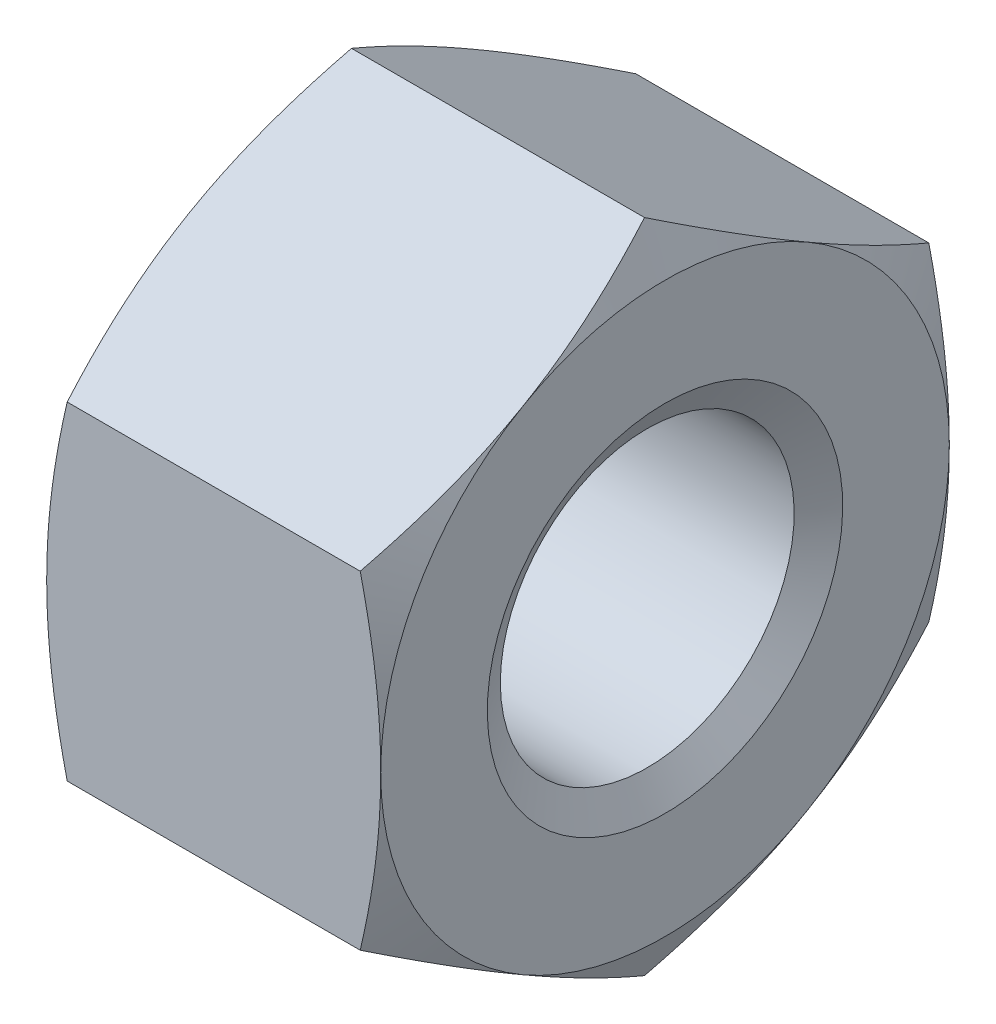
ISO-10303-21;
HEADER;
FILE_DESCRIPTION(('STEP AP214'),'2;1');
FILE_NAME('part.step','',(''),(''),'','','');
FILE_SCHEMA(('AUTOMOTIVE_DESIGN { 1 0 10303 214 1 1 1 1 }'));
ENDSEC;
DATA;
#1=APPLICATION_CONTEXT('core data for automotive mechanical design processes');
#2=APPLICATION_PROTOCOL_DEFINITION('international standard','automotive_design',2000,#1);
#3=PRODUCT_CONTEXT('',#1,'mechanical');
#4=PRODUCT('Part','Part','',(#3));
#5=PRODUCT_RELATED_PRODUCT_CATEGORY('part','',(#4));
#6=PRODUCT_DEFINITION_FORMATION('','',#4);
#7=PRODUCT_DEFINITION_CONTEXT('part definition',#1,'design');
#8=PRODUCT_DEFINITION('design','',#6,#7);
#9=PRODUCT_DEFINITION_SHAPE('','',#8);
#10=(LENGTH_UNIT() NAMED_UNIT(*) SI_UNIT(.MILLI.,.METRE.));
#11=(NAMED_UNIT(*) PLANE_ANGLE_UNIT() SI_UNIT($,.RADIAN.));
#12=(NAMED_UNIT(*) SI_UNIT($,.STERADIAN.) SOLID_ANGLE_UNIT());
#13=UNCERTAINTY_MEASURE_WITH_UNIT(LENGTH_MEASURE(1.E-05),#10,'distance_accuracy_value','');
#14=(GEOMETRIC_REPRESENTATION_CONTEXT(3) GLOBAL_UNCERTAINTY_ASSIGNED_CONTEXT((#13)) GLOBAL_UNIT_ASSIGNED_CONTEXT((#10,
#11,#12)) REPRESENTATION_CONTEXT('',''));
#15=CARTESIAN_POINT('',(0.,0.,0.));
#16=DIRECTION('',(0.,0.,1.));
#17=DIRECTION('',(1.,0.,0.));
#18=AXIS2_PLACEMENT_3D('',#15,#16,#17);
#19=CARTESIAN_POINT('',(0.125,0.,0.));
#20=DIRECTION('',(-1.,0.,0.));
#21=DIRECTION('',(0.,0.,1.));
#22=AXIS2_PLACEMENT_3D('',#19,#20,#21);
#23=CONICAL_SURFACE('',#22,2.28350635094611,1.0471975511966);
#24=CARTESIAN_POINT('',(0.25,0.,0.));
#25=DIRECTION('',(1.,0.,0.));
#26=DIRECTION('',(0.,1.,0.));
#27=AXIS2_PLACEMENT_3D('',#24,#25,#26);
#28=CIRCLE('',#27,2.067);
#29=CARTESIAN_POINT('',(0.25,2.067,0.));
#30=VERTEX_POINT('',#29);
#31=EDGE_CURVE('E10',#30,#30,#28,.T.);
#32=ORIENTED_EDGE('',*,*,#31,.T.);
#33=EDGE_LOOP('',(#32));
#34=FACE_BOUND('',#33,.T.);
#35=CARTESIAN_POINT('',(0.,0.,0.));
#36=DIRECTION('',(-1.,0.,0.));
#37=DIRECTION('',(0.,0.,1.));
#38=AXIS2_PLACEMENT_3D('',#35,#36,#37);
#39=CIRCLE('',#38,2.50001270189222);
#40=CARTESIAN_POINT('',(0.,0.,2.50001270189222));
#41=VERTEX_POINT('',#40);
#42=EDGE_CURVE('E25',#41,#41,#39,.T.);
#43=ORIENTED_EDGE('',*,*,#42,.T.);
#44=EDGE_LOOP('',(#43));
#45=FACE_BOUND('',#44,.T.);
#46=ADVANCED_FACE('F15',(#34,#45),#23,.F.);
#47=CARTESIAN_POINT('',(-8.39287337956546,0.,0.));
#48=DIRECTION('',(1.,0.,0.));
#49=DIRECTION('',(0.,1.,0.));
#50=AXIS2_PLACEMENT_3D('',#47,#48,#49);
#51=CYLINDRICAL_SURFACE('',#50,2.067);
#52=CARTESIAN_POINT('',(4.45,0.,0.));
#53=DIRECTION('',(-1.,0.,0.));
#54=DIRECTION('',(0.,0.,1.));
#55=AXIS2_PLACEMENT_3D('',#52,#53,#54);
#56=CIRCLE('',#55,2.067);
#57=CARTESIAN_POINT('',(4.45,0.,2.067));
#58=VERTEX_POINT('',#57);
#59=EDGE_CURVE('E330',#58,#58,#56,.T.);
#60=ORIENTED_EDGE('',*,*,#59,.F.);
#61=EDGE_LOOP('',(#60));
#62=FACE_BOUND('',#61,.T.);
#63=ORIENTED_EDGE('',*,*,#31,.F.);
#64=EDGE_LOOP('',(#63));
#65=FACE_BOUND('',#64,.T.);
#66=ADVANCED_FACE('F358',(#62,#65),#51,.F.);
#67=CARTESIAN_POINT('',(0.,0.,0.));
#68=DIRECTION('',(1.,0.,0.));
#69=DIRECTION('',(0.,0.,-1.));
#70=AXIS2_PLACEMENT_3D('',#67,#68,#69);
#71=PLANE('',#70);
#72=CARTESIAN_POINT('',(0.,0.,0.));
#73=DIRECTION('',(-1.,0.,0.));
#74=DIRECTION('',(0.,0.,1.));
#75=AXIS2_PLACEMENT_3D('',#72,#73,#74);
#76=CIRCLE('',#75,4.);
#77=CARTESIAN_POINT('',(0.,-3.46410161513775,-2.));
#78=VERTEX_POINT('',#77);
#79=CARTESIAN_POINT('',(0.,-3.46410161513776,2.));
#80=VERTEX_POINT('',#79);
#81=EDGE_CURVE('E346',#78,#80,#76,.T.);
#82=ORIENTED_EDGE('',*,*,#81,.T.);
#83=CARTESIAN_POINT('',(0.,0.,0.));
#84=DIRECTION('',(-1.,0.,0.));
#85=DIRECTION('',(0.,0.,1.));
#86=AXIS2_PLACEMENT_3D('',#83,#84,#85);
#87=CIRCLE('',#86,4.);
#88=CARTESIAN_POINT('',(0.,0.,4.));
#89=VERTEX_POINT('',#88);
#90=EDGE_CURVE('E343',#80,#89,#87,.T.);
#91=ORIENTED_EDGE('',*,*,#90,.T.);
#92=CARTESIAN_POINT('',(0.,0.,0.));
#93=DIRECTION('',(-1.,0.,0.));
#94=DIRECTION('',(0.,0.,1.));
#95=AXIS2_PLACEMENT_3D('',#92,#93,#94);
#96=CIRCLE('',#95,4.);
#97=CARTESIAN_POINT('',(0.,3.46410161513775,2.));
#98=VERTEX_POINT('',#97);
#99=EDGE_CURVE('E340',#89,#98,#96,.T.);
#100=ORIENTED_EDGE('',*,*,#99,.T.);
#101=CARTESIAN_POINT('',(0.,0.,0.));
#102=DIRECTION('',(-1.,0.,0.));
#103=DIRECTION('',(0.,0.,1.));
#104=AXIS2_PLACEMENT_3D('',#101,#102,#103);
#105=CIRCLE('',#104,4.);
#106=CARTESIAN_POINT('',(0.,3.46410161513776,-2.));
#107=VERTEX_POINT('',#106);
#108=EDGE_CURVE('E337',#98,#107,#105,.T.);
#109=ORIENTED_EDGE('',*,*,#108,.T.);
#110=CARTESIAN_POINT('',(0.,0.,0.));
#111=DIRECTION('',(-1.,0.,0.));
#112=DIRECTION('',(0.,0.,1.));
#113=AXIS2_PLACEMENT_3D('',#110,#111,#112);
#114=CIRCLE('',#113,4.);
#115=CARTESIAN_POINT('',(0.,0.,-4.));
#116=VERTEX_POINT('',#115);
#117=EDGE_CURVE('E334',#107,#116,#114,.T.);
#118=ORIENTED_EDGE('',*,*,#117,.T.);
#119=CARTESIAN_POINT('',(0.,0.,0.));
#120=DIRECTION('',(-1.,0.,0.));
#121=DIRECTION('',(0.,0.,1.));
#122=AXIS2_PLACEMENT_3D('',#119,#120,#121);
#123=CIRCLE('',#122,4.);
#124=EDGE_CURVE('E331',#116,#78,#123,.T.);
#125=ORIENTED_EDGE('',*,*,#124,.T.);
#126=EDGE_LOOP('',(#82,#91,#100,#109,#118,#125));
#127=FACE_BOUND('',#126,.T.);
#128=ORIENTED_EDGE('',*,*,#42,.F.);
#129=EDGE_LOOP('',(#128));
#130=FACE_BOUND('',#129,.T.);
#131=ADVANCED_FACE('F355',(#127,#130),#71,.F.);
#132=CARTESIAN_POINT('',(4.575,0.,0.));
#133=DIRECTION('',(1.,0.,0.));
#134=DIRECTION('',(0.,1.,0.));
#135=AXIS2_PLACEMENT_3D('',#132,#133,#134);
#136=CONICAL_SURFACE('',#135,2.28350635094611,1.0471975511966);
#137=ORIENTED_EDGE('',*,*,#59,.T.);
#138=EDGE_LOOP('',(#137));
#139=FACE_BOUND('',#138,.T.);
#140=CARTESIAN_POINT('',(4.7,0.,0.));
#141=DIRECTION('',(1.,0.,0.));
#142=DIRECTION('',(0.,1.,0.));
#143=AXIS2_PLACEMENT_3D('',#140,#141,#142);
#144=CIRCLE('',#143,2.50001270189222);
#145=CARTESIAN_POINT('',(4.7,2.50001270189222,0.));
#146=VERTEX_POINT('',#145);
#147=EDGE_CURVE('E327',#146,#146,#144,.T.);
#148=ORIENTED_EDGE('',*,*,#147,.T.);
#149=EDGE_LOOP('',(#148));
#150=FACE_BOUND('',#149,.T.);
#151=ADVANCED_FACE('F357',(#139,#150),#136,.F.);
#152=CARTESIAN_POINT('',(4.7,0.,0.));
#153=DIRECTION('',(1.,0.,0.));
#154=DIRECTION('',(0.,0.,-1.));
#155=AXIS2_PLACEMENT_3D('',#152,#153,#154);
#156=PLANE('',#155);
#157=CARTESIAN_POINT('',(4.7,0.,0.));
#158=DIRECTION('',(1.,0.,0.));
#159=DIRECTION('',(0.,1.,0.));
#160=AXIS2_PLACEMENT_3D('',#157,#158,#159);
#161=CIRCLE('',#160,4.);
#162=CARTESIAN_POINT('',(4.7,-3.46410161513775,-2.));
#163=VERTEX_POINT('',#162);
#164=CARTESIAN_POINT('',(4.7,0.,-4.));
#165=VERTEX_POINT('',#164);
#166=EDGE_CURVE('E324',#163,#165,#161,.T.);
#167=ORIENTED_EDGE('',*,*,#166,.T.);
#168=CARTESIAN_POINT('',(4.7,0.,0.));
#169=DIRECTION('',(1.,0.,0.));
#170=DIRECTION('',(0.,1.,0.));
#171=AXIS2_PLACEMENT_3D('',#168,#169,#170);
#172=CIRCLE('',#171,4.);
#173=CARTESIAN_POINT('',(4.7,3.46410161513776,-2.));
#174=VERTEX_POINT('',#173);
#175=EDGE_CURVE('E322',#165,#174,#172,.T.);
#176=ORIENTED_EDGE('',*,*,#175,.T.);
#177=CARTESIAN_POINT('',(4.7,0.,0.));
#178=DIRECTION('',(1.,0.,0.));
#179=DIRECTION('',(0.,1.,0.));
#180=AXIS2_PLACEMENT_3D('',#177,#178,#179);
#181=CIRCLE('',#180,4.);
#182=CARTESIAN_POINT('',(4.7,3.46410161513775,2.));
#183=VERTEX_POINT('',#182);
#184=EDGE_CURVE('E112',#174,#183,#181,.T.);
#185=ORIENTED_EDGE('',*,*,#184,.T.);
#186=CARTESIAN_POINT('',(4.7,0.,0.));
#187=DIRECTION('',(1.,0.,0.));
#188=DIRECTION('',(0.,1.,0.));
#189=AXIS2_PLACEMENT_3D('',#186,#187,#188);
#190=CIRCLE('',#189,4.);
#191=CARTESIAN_POINT('',(4.7,0.,4.));
#192=VERTEX_POINT('',#191);
#193=EDGE_CURVE('E318',#183,#192,#190,.T.);
#194=ORIENTED_EDGE('',*,*,#193,.T.);
#195=CARTESIAN_POINT('',(4.7,0.,0.));
#196=DIRECTION('',(1.,0.,0.));
#197=DIRECTION('',(0.,1.,0.));
#198=AXIS2_PLACEMENT_3D('',#195,#196,#197);
#199=CIRCLE('',#198,4.);
#200=CARTESIAN_POINT('',(4.7,-3.46410161513776,2.));
#201=VERTEX_POINT('',#200);
#202=EDGE_CURVE('E315',#192,#201,#199,.T.);
#203=ORIENTED_EDGE('',*,*,#202,.T.);
#204=CARTESIAN_POINT('',(4.7,0.,0.));
#205=DIRECTION('',(1.,0.,0.));
#206=DIRECTION('',(0.,1.,0.));
#207=AXIS2_PLACEMENT_3D('',#204,#205,#206);
#208=CIRCLE('',#207,4.);
#209=EDGE_CURVE('E237',#201,#163,#208,.T.);
#210=ORIENTED_EDGE('',*,*,#209,.T.);
#211=EDGE_LOOP('',(#167,#176,#185,#194,#203,#210));
#212=FACE_BOUND('',#211,.T.);
#213=ORIENTED_EDGE('',*,*,#147,.F.);
#214=EDGE_LOOP('',(#213));
#215=FACE_BOUND('',#214,.T.);
#216=ADVANCED_FACE('F366',(#212,#215),#156,.T.);
#217=CARTESIAN_POINT('',(0.144276091533892,0.,0.));
#218=DIRECTION('',(1.,0.,0.));
#219=DIRECTION('',(0.,0.,1.));
#220=AXIS2_PLACEMENT_3D('',#217,#218,#219);
#221=CONICAL_SURFACE('',#220,4.3094010767585,1.13446401379631);
#222=CARTESIAN_POINT('',(0.,-3.46410161513776,2.));
#223=CARTESIAN_POINT('',(0.,-4.,1.07179676972449));
#224=CARTESIAN_POINT('',(0.288552183067785,-4.618802153517,0.));
#225=(BOUNDED_CURVE() B_SPLINE_CURVE(2,(#222,#223,#224),.UNSPECIFIED.,.F.,
.F.) B_SPLINE_CURVE_WITH_KNOTS((3,3),(0.233129855179429,0.466259710358859),
.UNSPECIFIED.) CURVE() GEOMETRIC_REPRESENTATION_ITEM() RATIONAL_B_SPLINE_CURVE((1.,
1.03795484930205,1.)) REPRESENTATION_ITEM(''));
#226=CARTESIAN_POINT('',(0.288552183067785,-4.61880215351701,0.));
#227=VERTEX_POINT('',#226);
#228=EDGE_CURVE('E34',#80,#227,#225,.T.);
#229=ORIENTED_EDGE('',*,*,#228,.F.);
#230=ORIENTED_EDGE('',*,*,#81,.F.);
#231=CARTESIAN_POINT('',(0.288552183067785,-4.61880215351701,0.));
#232=CARTESIAN_POINT('',(0.,-4.,-1.07179676972449));
#233=CARTESIAN_POINT('',(0.,-3.46410161513775,-2.));
#234=(BOUNDED_CURVE() B_SPLINE_CURVE(2,(#231,#232,#233),.UNSPECIFIED.,.F.,
.F.) B_SPLINE_CURVE_WITH_KNOTS((3,3),(0.,0.23312985517943),
.UNSPECIFIED.) CURVE() GEOMETRIC_REPRESENTATION_ITEM() RATIONAL_B_SPLINE_CURVE((1.,
1.03795484930204,1.)) REPRESENTATION_ITEM(''));
#235=EDGE_CURVE('E224',#227,#78,#234,.T.);
#236=ORIENTED_EDGE('',*,*,#235,.F.);
#237=EDGE_LOOP('',(#229,#230,#236));
#238=FACE_BOUND('',#237,.T.);
#239=ADVANCED_FACE('F379',(#238),#221,.T.);
#240=CARTESIAN_POINT('',(0.144276091533892,0.,0.));
#241=DIRECTION('',(1.,0.,0.));
#242=DIRECTION('',(0.,0.,1.));
#243=AXIS2_PLACEMENT_3D('',#240,#241,#242);
#244=CONICAL_SURFACE('',#243,4.3094010767585,1.13446401379631);
#245=CARTESIAN_POINT('',(0.288552183067785,-2.30940107675848,-4.00000000000001));
#246=CARTESIAN_POINT('',(0.,-1.07179676972447,-4.00000000000001));
#247=CARTESIAN_POINT('',(0.,0.,-4.));
#248=(BOUNDED_CURVE() B_SPLINE_CURVE(2,(#245,#246,#247),.UNSPECIFIED.,.F.,
.F.) B_SPLINE_CURVE_WITH_KNOTS((3,3),(0.,0.233129855179429),
.UNSPECIFIED.) CURVE() GEOMETRIC_REPRESENTATION_ITEM() RATIONAL_B_SPLINE_CURVE((1.,
1.03795484930204,1.)) REPRESENTATION_ITEM(''));
#249=CARTESIAN_POINT('',(0.288552183067785,-2.30940107675848,-4.00000000000001));
#250=VERTEX_POINT('',#249);
#251=EDGE_CURVE('E157',#250,#116,#248,.T.);
#252=ORIENTED_EDGE('',*,*,#251,.F.);
#253=CARTESIAN_POINT('',(0.,-3.46410161513775,-2.));
#254=CARTESIAN_POINT('',(0.,-2.9282032302755,-2.92820323027551));
#255=CARTESIAN_POINT('',(0.288552183067785,-2.3094010767585,-4.));
#256=(BOUNDED_CURVE() B_SPLINE_CURVE(2,(#253,#254,#255),.UNSPECIFIED.,.F.,
.F.) B_SPLINE_CURVE_WITH_KNOTS((3,3),(0.23312985517943,0.46625971035886),
.UNSPECIFIED.) CURVE() GEOMETRIC_REPRESENTATION_ITEM() RATIONAL_B_SPLINE_CURVE((1.,
1.03795484930204,1.)) REPRESENTATION_ITEM(''));
#257=EDGE_CURVE('E284',#78,#250,#256,.T.);
#258=ORIENTED_EDGE('',*,*,#257,.F.);
#259=ORIENTED_EDGE('',*,*,#124,.F.);
#260=EDGE_LOOP('',(#252,#258,#259));
#261=FACE_BOUND('',#260,.T.);
#262=ADVANCED_FACE('F382',(#261),#244,.T.);
#263=CARTESIAN_POINT('',(0.144276091533892,0.,0.));
#264=DIRECTION('',(1.,0.,0.));
#265=DIRECTION('',(0.,0.,1.));
#266=AXIS2_PLACEMENT_3D('',#263,#264,#265);
#267=CONICAL_SURFACE('',#266,4.3094010767585,1.13446401379631);
#268=CARTESIAN_POINT('',(0.,0.,4.));
#269=CARTESIAN_POINT('',(0.,-1.07179676972449,4.));
#270=CARTESIAN_POINT('',(0.288552183067785,-2.3094010767585,4.));
#271=(BOUNDED_CURVE() B_SPLINE_CURVE(2,(#268,#269,#270),.UNSPECIFIED.,.F.,
.F.) B_SPLINE_CURVE_WITH_KNOTS((3,3),(0.233129855179429,0.466259710358859),
.UNSPECIFIED.) CURVE() GEOMETRIC_REPRESENTATION_ITEM() RATIONAL_B_SPLINE_CURVE((1.,
1.03795484930203,1.)) REPRESENTATION_ITEM(''));
#272=CARTESIAN_POINT('',(0.288552183067785,-2.3094010767585,4.));
#273=VERTEX_POINT('',#272);
#274=EDGE_CURVE('E142',#89,#273,#271,.T.);
#275=ORIENTED_EDGE('',*,*,#274,.F.);
#276=ORIENTED_EDGE('',*,*,#90,.F.);
#277=CARTESIAN_POINT('',(0.288552183067785,-2.30940107675851,4.));
#278=CARTESIAN_POINT('',(0.,-2.92820323027551,2.92820323027551));
#279=CARTESIAN_POINT('',(0.,-3.46410161513776,2.));
#280=(BOUNDED_CURVE() B_SPLINE_CURVE(2,(#277,#278,#279),.UNSPECIFIED.,.F.,
.F.) B_SPLINE_CURVE_WITH_KNOTS((3,3),(0.,0.233129855179429),
.UNSPECIFIED.) CURVE() GEOMETRIC_REPRESENTATION_ITEM() RATIONAL_B_SPLINE_CURVE((1.,
1.03795484930205,1.)) REPRESENTATION_ITEM(''));
#281=EDGE_CURVE('E185',#273,#80,#280,.T.);
#282=ORIENTED_EDGE('',*,*,#281,.F.);
#283=EDGE_LOOP('',(#275,#276,#282));
#284=FACE_BOUND('',#283,.T.);
#285=ADVANCED_FACE('F385',(#284),#267,.T.);
#286=CARTESIAN_POINT('',(0.144276091533892,0.,0.));
#287=DIRECTION('',(1.,0.,0.));
#288=DIRECTION('',(0.,0.,1.));
#289=AXIS2_PLACEMENT_3D('',#286,#287,#288);
#290=CONICAL_SURFACE('',#289,4.3094010767585,1.13446401379631);
#291=CARTESIAN_POINT('',(0.288552183067785,2.30940107675852,-3.99999999999999));
#292=CARTESIAN_POINT('',(0.,2.92820323027552,-2.9282032302755));
#293=CARTESIAN_POINT('',(0.,3.46410161513776,-2.));
#294=(BOUNDED_CURVE() B_SPLINE_CURVE(2,(#291,#292,#293),.UNSPECIFIED.,.F.,
.F.) B_SPLINE_CURVE_WITH_KNOTS((3,3),(0.,0.233129855179429),
.UNSPECIFIED.) CURVE() GEOMETRIC_REPRESENTATION_ITEM() RATIONAL_B_SPLINE_CURVE((1.,
1.03795484930204,1.)) REPRESENTATION_ITEM(''));
#295=CARTESIAN_POINT('',(0.288552183067785,2.30940107675851,-3.99999999999999));
#296=VERTEX_POINT('',#295);
#297=EDGE_CURVE('E152',#296,#107,#294,.T.);
#298=ORIENTED_EDGE('',*,*,#297,.F.);
#299=CARTESIAN_POINT('',(0.,0.,-4.));
#300=CARTESIAN_POINT('',(0.,1.07179676972449,-4.));
#301=CARTESIAN_POINT('',(0.288552183067785,2.3094010767585,-4.));
#302=(BOUNDED_CURVE() B_SPLINE_CURVE(2,(#299,#300,#301),.UNSPECIFIED.,.F.,
.F.) B_SPLINE_CURVE_WITH_KNOTS((3,3),(0.233129855179429,0.466259710358857),
.UNSPECIFIED.) CURVE() GEOMETRIC_REPRESENTATION_ITEM() RATIONAL_B_SPLINE_CURVE((1.,
1.03795484930204,1.)) REPRESENTATION_ITEM(''));
#303=EDGE_CURVE('E149',#116,#296,#302,.T.);
#304=ORIENTED_EDGE('',*,*,#303,.F.);
#305=ORIENTED_EDGE('',*,*,#117,.F.);
#306=EDGE_LOOP('',(#298,#304,#305));
#307=FACE_BOUND('',#306,.T.);
#308=ADVANCED_FACE('F389',(#307),#290,.T.);
#309=CARTESIAN_POINT('',(0.144276091533892,0.,0.));
#310=DIRECTION('',(1.,0.,0.));
#311=DIRECTION('',(0.,0.,1.));
#312=AXIS2_PLACEMENT_3D('',#309,#310,#311);
#313=CONICAL_SURFACE('',#312,4.3094010767585,1.13446401379631);
#314=CARTESIAN_POINT('',(0.,3.46410161513775,2.));
#315=CARTESIAN_POINT('',(0.,2.92820323027551,2.92820323027551));
#316=CARTESIAN_POINT('',(0.288552183067785,2.3094010767585,4.));
#317=(BOUNDED_CURVE() B_SPLINE_CURVE(2,(#314,#315,#316),.UNSPECIFIED.,.F.,
.F.) B_SPLINE_CURVE_WITH_KNOTS((3,3),(0.233129855179429,0.466259710358859),
.UNSPECIFIED.) CURVE() GEOMETRIC_REPRESENTATION_ITEM() RATIONAL_B_SPLINE_CURVE((1.,
1.03795484930205,1.)) REPRESENTATION_ITEM(''));
#318=CARTESIAN_POINT('',(0.288552183067785,2.3094010767585,4.));
#319=VERTEX_POINT('',#318);
#320=EDGE_CURVE('E238',#98,#319,#317,.T.);
#321=ORIENTED_EDGE('',*,*,#320,.F.);
#322=ORIENTED_EDGE('',*,*,#99,.F.);
#323=CARTESIAN_POINT('',(0.288552183067785,2.3094010767585,4.));
#324=CARTESIAN_POINT('',(0.,1.07179676972449,4.));
#325=CARTESIAN_POINT('',(0.,0.,4.));
#326=(BOUNDED_CURVE() B_SPLINE_CURVE(2,(#323,#324,#325),.UNSPECIFIED.,.F.,
.F.) B_SPLINE_CURVE_WITH_KNOTS((3,3),(0.,0.233129855179429),
.UNSPECIFIED.) CURVE() GEOMETRIC_REPRESENTATION_ITEM() RATIONAL_B_SPLINE_CURVE((1.,
1.03795484930203,1.)) REPRESENTATION_ITEM(''));
#327=EDGE_CURVE('E127',#319,#89,#326,.T.);
#328=ORIENTED_EDGE('',*,*,#327,.F.);
#329=EDGE_LOOP('',(#321,#322,#328));
#330=FACE_BOUND('',#329,.T.);
#331=ADVANCED_FACE('F393',(#330),#313,.T.);
#332=CARTESIAN_POINT('',(0.144276091533892,0.,0.));
#333=DIRECTION('',(1.,0.,0.));
#334=DIRECTION('',(0.,0.,1.));
#335=AXIS2_PLACEMENT_3D('',#332,#333,#334);
#336=CONICAL_SURFACE('',#335,4.3094010767585,1.13446401379631);
#337=CARTESIAN_POINT('',(0.,3.46410161513776,-2.));
#338=CARTESIAN_POINT('',(0.,4.,-1.07179676972449));
#339=CARTESIAN_POINT('',(0.288552183067785,4.61880215351701,0.));
#340=(BOUNDED_CURVE() B_SPLINE_CURVE(2,(#337,#338,#339),.UNSPECIFIED.,.F.,
.F.) B_SPLINE_CURVE_WITH_KNOTS((3,3),(0.233129855179429,0.466259710358858),
.UNSPECIFIED.) CURVE() GEOMETRIC_REPRESENTATION_ITEM() RATIONAL_B_SPLINE_CURVE((1.,
1.03795484930205,1.)) REPRESENTATION_ITEM(''));
#341=CARTESIAN_POINT('',(0.288552183067785,4.61880215351701,0.));
#342=VERTEX_POINT('',#341);
#343=EDGE_CURVE('E131',#107,#342,#340,.T.);
#344=ORIENTED_EDGE('',*,*,#343,.F.);
#345=ORIENTED_EDGE('',*,*,#108,.F.);
#346=CARTESIAN_POINT('',(0.288552183067785,4.61880215351701,0.));
#347=CARTESIAN_POINT('',(0.,4.,1.07179676972449));
#348=CARTESIAN_POINT('',(0.,3.46410161513775,2.));
#349=(BOUNDED_CURVE() B_SPLINE_CURVE(2,(#346,#347,#348),.UNSPECIFIED.,.F.,
.F.) B_SPLINE_CURVE_WITH_KNOTS((3,3),(0.,0.233129855179429),
.UNSPECIFIED.) CURVE() GEOMETRIC_REPRESENTATION_ITEM() RATIONAL_B_SPLINE_CURVE((1.,
1.03795484930205,1.)) REPRESENTATION_ITEM(''));
#350=EDGE_CURVE('E231',#342,#98,#349,.T.);
#351=ORIENTED_EDGE('',*,*,#350,.F.);
#352=EDGE_LOOP('',(#344,#345,#351));
#353=FACE_BOUND('',#352,.T.);
#354=ADVANCED_FACE('F395',(#353),#336,.T.);
#355=CARTESIAN_POINT('',(4.55572390846611,0.,0.));
#356=DIRECTION('',(-1.,0.,0.));
#357=DIRECTION('',(0.,0.,1.));
#358=AXIS2_PLACEMENT_3D('',#355,#356,#357);
#359=CONICAL_SURFACE('',#358,4.3094010767585,1.13446401379631);
#360=CARTESIAN_POINT('',(4.41144781693221,-4.61880215351701,0.));
#361=CARTESIAN_POINT('',(4.7,-4.,1.07179676972448));
#362=CARTESIAN_POINT('',(4.7,-3.46410161513776,2.));
#363=(BOUNDED_CURVE() B_SPLINE_CURVE(2,(#360,#361,#362),.UNSPECIFIED.,.F.,
.F.) B_SPLINE_CURVE_WITH_KNOTS((3,3),(0.,0.23312985517943),
.UNSPECIFIED.) CURVE() GEOMETRIC_REPRESENTATION_ITEM() RATIONAL_B_SPLINE_CURVE((1.,
1.03795484930201,1.)) REPRESENTATION_ITEM(''));
#364=CARTESIAN_POINT('',(4.41144781693222,-4.61880215351701,0.));
#365=VERTEX_POINT('',#364);
#366=EDGE_CURVE('E146',#365,#201,#363,.T.);
#367=ORIENTED_EDGE('',*,*,#366,.F.);
#368=CARTESIAN_POINT('',(4.7,-3.46410161513775,-2.));
#369=CARTESIAN_POINT('',(4.7,-4.,-1.07179676972449));
#370=CARTESIAN_POINT('',(4.41144781693221,-4.61880215351701,0.));
#371=(BOUNDED_CURVE() B_SPLINE_CURVE(2,(#368,#369,#370),.UNSPECIFIED.,.F.,
.F.) B_SPLINE_CURVE_WITH_KNOTS((3,3),(0.23312985517943,0.46625971035886),
.UNSPECIFIED.) CURVE() GEOMETRIC_REPRESENTATION_ITEM() RATIONAL_B_SPLINE_CURVE((1.,
1.03795484930206,1.)) REPRESENTATION_ITEM(''));
#372=EDGE_CURVE('E211',#163,#365,#371,.T.);
#373=ORIENTED_EDGE('',*,*,#372,.F.);
#374=ORIENTED_EDGE('',*,*,#209,.F.);
#375=EDGE_LOOP('',(#367,#373,#374));
#376=FACE_BOUND('',#375,.T.);
#377=ADVANCED_FACE('F398',(#376),#359,.T.);
#378=CARTESIAN_POINT('',(4.55572390846611,0.,0.));
#379=DIRECTION('',(-1.,0.,0.));
#380=DIRECTION('',(0.,0.,1.));
#381=AXIS2_PLACEMENT_3D('',#378,#379,#380);
#382=CONICAL_SURFACE('',#381,4.3094010767585,1.13446401379631);
#383=CARTESIAN_POINT('',(4.7,0.,-4.));
#384=CARTESIAN_POINT('',(4.7,-1.07179676972448,-4.00000000000001));
#385=CARTESIAN_POINT('',(4.41144781693221,-2.30940107675849,-4.00000000000001));
#386=(BOUNDED_CURVE() B_SPLINE_CURVE(2,(#383,#384,#385),.UNSPECIFIED.,.F.,
.F.) B_SPLINE_CURVE_WITH_KNOTS((3,3),(0.233129855179429,0.466259710358859),
.UNSPECIFIED.) CURVE() GEOMETRIC_REPRESENTATION_ITEM() RATIONAL_B_SPLINE_CURVE((1.,
1.03795484930207,1.)) REPRESENTATION_ITEM(''));
#387=CARTESIAN_POINT('',(4.41144781693222,-2.30940107675849,-4.00000000000001));
#388=VERTEX_POINT('',#387);
#389=EDGE_CURVE('E154',#165,#388,#386,.T.);
#390=ORIENTED_EDGE('',*,*,#389,.F.);
#391=ORIENTED_EDGE('',*,*,#166,.F.);
#392=CARTESIAN_POINT('',(4.41144781693221,-2.30940107675849,-4.00000000000001));
#393=CARTESIAN_POINT('',(4.7,-2.9282032302755,-2.92820323027551));
#394=CARTESIAN_POINT('',(4.7,-3.46410161513775,-2.));
#395=(BOUNDED_CURVE() B_SPLINE_CURVE(2,(#392,#393,#394),.UNSPECIFIED.,.F.,
.F.) B_SPLINE_CURVE_WITH_KNOTS((3,3),(0.,0.23312985517943),
.UNSPECIFIED.) CURVE() GEOMETRIC_REPRESENTATION_ITEM() RATIONAL_B_SPLINE_CURVE((1.,
1.03795484930208,1.)) REPRESENTATION_ITEM(''));
#396=EDGE_CURVE('E204',#388,#163,#395,.T.);
#397=ORIENTED_EDGE('',*,*,#396,.F.);
#398=EDGE_LOOP('',(#390,#391,#397));
#399=FACE_BOUND('',#398,.T.);
#400=ADVANCED_FACE('F405',(#399),#382,.T.);
#401=CARTESIAN_POINT('',(4.55572390846611,0.,0.));
#402=DIRECTION('',(-1.,0.,0.));
#403=DIRECTION('',(0.,0.,1.));
#404=AXIS2_PLACEMENT_3D('',#401,#402,#403);
#405=CONICAL_SURFACE('',#404,4.3094010767585,1.13446401379631);
#406=CARTESIAN_POINT('',(4.41144781693221,-2.30940107675851,4.));
#407=CARTESIAN_POINT('',(4.7,-1.07179676972449,4.));
#408=CARTESIAN_POINT('',(4.7,0.,4.));
#409=(BOUNDED_CURVE() B_SPLINE_CURVE(2,(#406,#407,#408),.UNSPECIFIED.,.F.,
.F.) B_SPLINE_CURVE_WITH_KNOTS((3,3),(0.,0.23312985517943),
.UNSPECIFIED.) CURVE() GEOMETRIC_REPRESENTATION_ITEM() RATIONAL_B_SPLINE_CURVE((1.,
1.03795484930202,1.)) REPRESENTATION_ITEM(''));
#410=CARTESIAN_POINT('',(4.41144781693222,-2.3094010767585,4.));
#411=VERTEX_POINT('',#410);
#412=EDGE_CURVE('E143',#411,#192,#409,.T.);
#413=ORIENTED_EDGE('',*,*,#412,.F.);
#414=CARTESIAN_POINT('',(4.7,-3.46410161513776,2.));
#415=CARTESIAN_POINT('',(4.7,-2.92820323027551,2.92820323027552));
#416=CARTESIAN_POINT('',(4.41144781693221,-2.3094010767585,4.00000000000001));
#417=(BOUNDED_CURVE() B_SPLINE_CURVE(2,(#414,#415,#416),.UNSPECIFIED.,.F.,
.F.) B_SPLINE_CURVE_WITH_KNOTS((3,3),(0.23312985517943,0.466259710358861),
.UNSPECIFIED.) CURVE() GEOMETRIC_REPRESENTATION_ITEM() RATIONAL_B_SPLINE_CURVE((1.,
1.03795484930199,1.)) REPRESENTATION_ITEM(''));
#418=EDGE_CURVE('E134',#201,#411,#417,.T.);
#419=ORIENTED_EDGE('',*,*,#418,.F.);
#420=ORIENTED_EDGE('',*,*,#202,.F.);
#421=EDGE_LOOP('',(#413,#419,#420));
#422=FACE_BOUND('',#421,.T.);
#423=ADVANCED_FACE('F409',(#422),#405,.T.);
#424=CARTESIAN_POINT('',(4.55572390846611,0.,0.));
#425=DIRECTION('',(-1.,0.,0.));
#426=DIRECTION('',(0.,0.,1.));
#427=AXIS2_PLACEMENT_3D('',#424,#425,#426);
#428=CONICAL_SURFACE('',#427,4.3094010767585,1.13446401379631);
#429=CARTESIAN_POINT('',(4.41144781693221,2.3094010767585,4.));
#430=CARTESIAN_POINT('',(4.7,2.92820323027551,2.9282032302755));
#431=CARTESIAN_POINT('',(4.7,3.46410161513775,2.));
#432=(BOUNDED_CURVE() B_SPLINE_CURVE(2,(#429,#430,#431),.UNSPECIFIED.,.F.,
.F.) B_SPLINE_CURVE_WITH_KNOTS((3,3),(0.,0.23312985517943),
.UNSPECIFIED.) CURVE() GEOMETRIC_REPRESENTATION_ITEM() RATIONAL_B_SPLINE_CURVE((1.,
1.03795484930207,1.)) REPRESENTATION_ITEM(''));
#433=CARTESIAN_POINT('',(4.41144781693222,2.3094010767585,4.));
#434=VERTEX_POINT('',#433);
#435=EDGE_CURVE('E125',#434,#183,#432,.T.);
#436=ORIENTED_EDGE('',*,*,#435,.F.);
#437=CARTESIAN_POINT('',(4.7,0.,4.));
#438=CARTESIAN_POINT('',(4.7,1.07179676972449,4.));
#439=CARTESIAN_POINT('',(4.41144781693221,2.30940107675851,4.));
#440=(BOUNDED_CURVE() B_SPLINE_CURVE(2,(#437,#438,#439),.UNSPECIFIED.,.F.,
.F.) B_SPLINE_CURVE_WITH_KNOTS((3,3),(0.23312985517943,0.46625971035886),
.UNSPECIFIED.) CURVE() GEOMETRIC_REPRESENTATION_ITEM() RATIONAL_B_SPLINE_CURVE((1.,
1.03795484930202,1.)) REPRESENTATION_ITEM(''));
#441=EDGE_CURVE('E178',#192,#434,#440,.T.);
#442=ORIENTED_EDGE('',*,*,#441,.F.);
#443=ORIENTED_EDGE('',*,*,#193,.F.);
#444=EDGE_LOOP('',(#436,#442,#443));
#445=FACE_BOUND('',#444,.T.);
#446=ADVANCED_FACE('F414',(#445),#428,.T.);
#447=CARTESIAN_POINT('',(4.55572390846611,0.,0.));
#448=DIRECTION('',(-1.,0.,0.));
#449=DIRECTION('',(0.,0.,1.));
#450=AXIS2_PLACEMENT_3D('',#447,#448,#449);
#451=CONICAL_SURFACE('',#450,4.3094010767585,1.13446401379631);
#452=CARTESIAN_POINT('',(4.7,3.46410161513776,-2.));
#453=CARTESIAN_POINT('',(4.7,2.92820323027552,-2.9282032302755));
#454=CARTESIAN_POINT('',(4.41144781693221,2.30940107675851,-3.99999999999999));
#455=(BOUNDED_CURVE() B_SPLINE_CURVE(2,(#452,#453,#454),.UNSPECIFIED.,.F.,
.F.) B_SPLINE_CURVE_WITH_KNOTS((3,3),(0.233129855179429,0.466259710358858),
.UNSPECIFIED.) CURVE() GEOMETRIC_REPRESENTATION_ITEM() RATIONAL_B_SPLINE_CURVE((1.,
1.03795484930202,1.)) REPRESENTATION_ITEM(''));
#456=CARTESIAN_POINT('',(4.41144781693222,2.30940107675851,-3.99999999999999));
#457=VERTEX_POINT('',#456);
#458=EDGE_CURVE('E117',#174,#457,#455,.T.);
#459=ORIENTED_EDGE('',*,*,#458,.F.);
#460=ORIENTED_EDGE('',*,*,#175,.F.);
#461=CARTESIAN_POINT('',(4.41144781693221,2.30940107675851,-4.));
#462=CARTESIAN_POINT('',(4.7,1.0717967697245,-4.));
#463=CARTESIAN_POINT('',(4.7,0.,-4.));
#464=(BOUNDED_CURVE() B_SPLINE_CURVE(2,(#461,#462,#463),.UNSPECIFIED.,.F.,
.F.) B_SPLINE_CURVE_WITH_KNOTS((3,3),(0.,0.233129855179429),
.UNSPECIFIED.) CURVE() GEOMETRIC_REPRESENTATION_ITEM() RATIONAL_B_SPLINE_CURVE((1.,
1.03795484930206,1.)) REPRESENTATION_ITEM(''));
#465=EDGE_CURVE('E101',#457,#165,#464,.T.);
#466=ORIENTED_EDGE('',*,*,#465,.F.);
#467=EDGE_LOOP('',(#459,#460,#466));
#468=FACE_BOUND('',#467,.T.);
#469=ADVANCED_FACE('F411',(#468),#451,.T.);
#470=CARTESIAN_POINT('',(4.55572390846611,0.,0.));
#471=DIRECTION('',(-1.,0.,0.));
#472=DIRECTION('',(0.,0.,1.));
#473=AXIS2_PLACEMENT_3D('',#470,#471,#472);
#474=CONICAL_SURFACE('',#473,4.3094010767585,1.13446401379631);
#475=CARTESIAN_POINT('',(4.7,3.46410161513775,2.));
#476=CARTESIAN_POINT('',(4.7,4.,1.0717967697245));
#477=CARTESIAN_POINT('',(4.41144781693221,4.61880215351701,0.));
#478=(BOUNDED_CURVE() B_SPLINE_CURVE(2,(#475,#476,#477),.UNSPECIFIED.,.F.,
.F.) B_SPLINE_CURVE_WITH_KNOTS((3,3),(0.23312985517943,0.466259710358859),
.UNSPECIFIED.) CURVE() GEOMETRIC_REPRESENTATION_ITEM() RATIONAL_B_SPLINE_CURVE((1.,
1.03795484930205,1.)) REPRESENTATION_ITEM(''));
#479=CARTESIAN_POINT('',(4.41144781693222,4.61880215351701,0.));
#480=VERTEX_POINT('',#479);
#481=EDGE_CURVE('E110',#183,#480,#478,.T.);
#482=ORIENTED_EDGE('',*,*,#481,.F.);
#483=ORIENTED_EDGE('',*,*,#184,.F.);
#484=CARTESIAN_POINT('',(4.41144781693221,4.61880215351701,0.));
#485=CARTESIAN_POINT('',(4.7,4.,-1.07179676972449));
#486=CARTESIAN_POINT('',(4.7,3.46410161513776,-2.));
#487=(BOUNDED_CURVE() B_SPLINE_CURVE(2,(#484,#485,#486),.UNSPECIFIED.,.F.,
.F.) B_SPLINE_CURVE_WITH_KNOTS((3,3),(0.,0.233129855179429),
.UNSPECIFIED.) CURVE() GEOMETRIC_REPRESENTATION_ITEM() RATIONAL_B_SPLINE_CURVE((1.,
1.03795484930203,1.)) REPRESENTATION_ITEM(''));
#488=EDGE_CURVE('E108',#480,#174,#487,.T.);
#489=ORIENTED_EDGE('',*,*,#488,.F.);
#490=EDGE_LOOP('',(#482,#483,#489));
#491=FACE_BOUND('',#490,.T.);
#492=ADVANCED_FACE('F17',(#491),#474,.T.);
#493=CARTESIAN_POINT('',(0.,2.3094010767585,4.));
#494=DIRECTION('',(0.,0.866025403784438,0.5));
#495=DIRECTION('',(0.,-0.5,0.866025403784438));
#496=AXIS2_PLACEMENT_3D('',#493,#494,#495);
#497=PLANE('',#496);
#498=ORIENTED_EDGE('',*,*,#350,.T.);
#499=ORIENTED_EDGE('',*,*,#320,.T.);
#500=DIRECTION('',(1.,0.,0.));
#501=VECTOR('',#500,1.);
#502=CARTESIAN_POINT('',(0.,2.3094010767585,4.));
#503=LINE('',#502,#501);
#504=EDGE_CURVE('E138',#319,#434,#503,.T.);
#505=ORIENTED_EDGE('',*,*,#504,.T.);
#506=ORIENTED_EDGE('',*,*,#435,.T.);
#507=ORIENTED_EDGE('',*,*,#481,.T.);
#508=DIRECTION('',(1.,0.,0.));
#509=VECTOR('',#508,1.);
#510=CARTESIAN_POINT('',(0.,4.61880215351701,0.));
#511=LINE('',#510,#509);
#512=EDGE_CURVE('E116',#342,#480,#511,.T.);
#513=ORIENTED_EDGE('',*,*,#512,.F.);
#514=EDGE_LOOP('',(#498,#499,#505,#506,#507,#513));
#515=FACE_BOUND('',#514,.T.);
#516=ADVANCED_FACE('F122',(#515),#497,.T.);
#517=CARTESIAN_POINT('',(0.,-2.3094010767585,4.));
#518=DIRECTION('',(0.,0.,1.));
#519=DIRECTION('',(1.,0.,0.));
#520=AXIS2_PLACEMENT_3D('',#517,#518,#519);
#521=PLANE('',#520);
#522=ORIENTED_EDGE('',*,*,#327,.T.);
#523=ORIENTED_EDGE('',*,*,#274,.T.);
#524=DIRECTION('',(1.,0.,0.));
#525=VECTOR('',#524,1.);
#526=CARTESIAN_POINT('',(0.,-2.3094010767585,4.));
#527=LINE('',#526,#525);
#528=EDGE_CURVE('E139',#273,#411,#527,.T.);
#529=ORIENTED_EDGE('',*,*,#528,.T.);
#530=ORIENTED_EDGE('',*,*,#412,.T.);
#531=ORIENTED_EDGE('',*,*,#441,.T.);
#532=ORIENTED_EDGE('',*,*,#504,.F.);
#533=EDGE_LOOP('',(#522,#523,#529,#530,#531,#532));
#534=FACE_BOUND('',#533,.T.);
#535=ADVANCED_FACE('F426',(#534),#521,.T.);
#536=CARTESIAN_POINT('',(0.,-4.61880215351701,0.));
#537=DIRECTION('',(0.,-0.866025403784439,0.5));
#538=DIRECTION('',(0.,-0.5,-0.866025403784439));
#539=AXIS2_PLACEMENT_3D('',#536,#537,#538);
#540=PLANE('',#539);
#541=ORIENTED_EDGE('',*,*,#281,.T.);
#542=ORIENTED_EDGE('',*,*,#228,.T.);
#543=DIRECTION('',(1.,0.,0.));
#544=VECTOR('',#543,1.);
#545=CARTESIAN_POINT('',(0.,-4.61880215351701,0.));
#546=LINE('',#545,#544);
#547=EDGE_CURVE('E144',#227,#365,#546,.T.);
#548=ORIENTED_EDGE('',*,*,#547,.T.);
#549=ORIENTED_EDGE('',*,*,#366,.T.);
#550=ORIENTED_EDGE('',*,*,#418,.T.);
#551=ORIENTED_EDGE('',*,*,#528,.F.);
#552=EDGE_LOOP('',(#541,#542,#548,#549,#550,#551));
#553=FACE_BOUND('',#552,.T.);
#554=ADVANCED_FACE('F428',(#553),#540,.T.);
#555=CARTESIAN_POINT('',(0.,4.61880215351701,0.));
#556=DIRECTION('',(0.,0.86602540378444,-0.499999999999999));
#557=DIRECTION('',(0.,0.499999999999999,0.86602540378444));
#558=AXIS2_PLACEMENT_3D('',#555,#556,#557);
#559=PLANE('',#558);
#560=ORIENTED_EDGE('',*,*,#343,.T.);
#561=ORIENTED_EDGE('',*,*,#512,.T.);
#562=ORIENTED_EDGE('',*,*,#488,.T.);
#563=ORIENTED_EDGE('',*,*,#458,.T.);
#564=DIRECTION('',(1.,0.,0.));
#565=VECTOR('',#564,1.);
#566=CARTESIAN_POINT('',(0.,2.30940107675851,-4.));
#567=LINE('',#566,#565);
#568=EDGE_CURVE('E147',#296,#457,#567,.T.);
#569=ORIENTED_EDGE('',*,*,#568,.F.);
#570=ORIENTED_EDGE('',*,*,#297,.T.);
#571=EDGE_LOOP('',(#560,#561,#562,#563,#569,#570));
#572=FACE_BOUND('',#571,.T.);
#573=ADVANCED_FACE('F129',(#572),#559,.T.);
#574=CARTESIAN_POINT('',(0.,2.30940107675851,-4.));
#575=DIRECTION('',(0.,0.,-1.));
#576=DIRECTION('',(0.,1.,0.));
#577=AXIS2_PLACEMENT_3D('',#574,#575,#576);
#578=PLANE('',#577);
#579=ORIENTED_EDGE('',*,*,#303,.T.);
#580=ORIENTED_EDGE('',*,*,#568,.T.);
#581=ORIENTED_EDGE('',*,*,#465,.T.);
#582=ORIENTED_EDGE('',*,*,#389,.T.);
#583=DIRECTION('',(1.,0.,0.));
#584=VECTOR('',#583,1.);
#585=CARTESIAN_POINT('',(0.,-2.30940107675849,-4.00000000000001));
#586=LINE('',#585,#584);
#587=EDGE_CURVE('E19',#250,#388,#586,.T.);
#588=ORIENTED_EDGE('',*,*,#587,.F.);
#589=ORIENTED_EDGE('',*,*,#251,.T.);
#590=EDGE_LOOP('',(#579,#580,#581,#582,#588,#589));
#591=FACE_BOUND('',#590,.T.);
#592=ADVANCED_FACE('F446',(#591),#578,.T.);
#593=CARTESIAN_POINT('',(0.,-2.30940107675849,-4.00000000000001));
#594=DIRECTION('',(0.,-0.866025403784438,-0.500000000000001));
#595=DIRECTION('',(0.,0.500000000000001,-0.866025403784438));
#596=AXIS2_PLACEMENT_3D('',#593,#594,#595);
#597=PLANE('',#596);
#598=ORIENTED_EDGE('',*,*,#257,.T.);
#599=ORIENTED_EDGE('',*,*,#587,.T.);
#600=ORIENTED_EDGE('',*,*,#396,.T.);
#601=ORIENTED_EDGE('',*,*,#372,.T.);
#602=ORIENTED_EDGE('',*,*,#547,.F.);
#603=ORIENTED_EDGE('',*,*,#235,.T.);
#604=EDGE_LOOP('',(#598,#599,#600,#601,#602,#603));
#605=FACE_BOUND('',#604,.T.);
#606=ADVANCED_FACE('F445',(#605),#597,.T.);
#607=CLOSED_SHELL('',(#46,#66,#131,#151,#216,#239,#262,#285,#308,#331,#354,#377,#400,#423,#446,
#469,#492,#516,#535,#554,#573,#592,#606));
#608=MANIFOLD_SOLID_BREP('B1',#607);
#609=ADVANCED_BREP_SHAPE_REPRESENTATION('',(#18,#608),#14);
#610=SHAPE_DEFINITION_REPRESENTATION(#9,#609);
ENDSEC;
END-ISO-10303-21;
